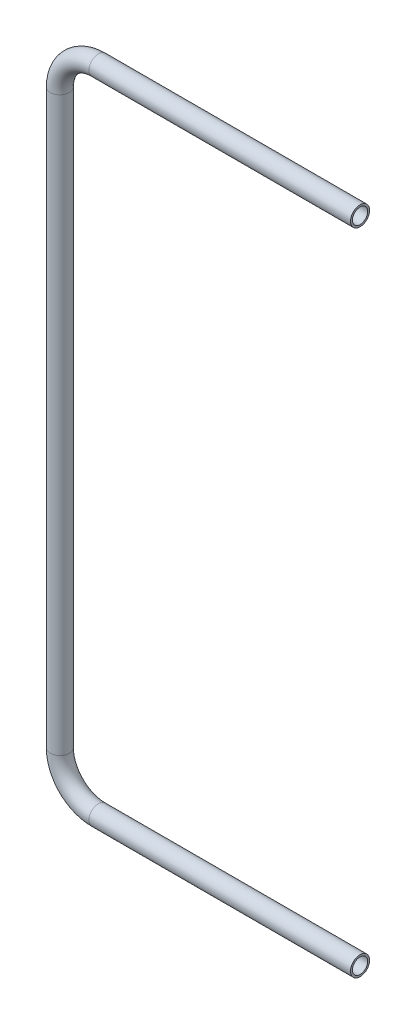
ISO-10303-21;
HEADER;
FILE_DESCRIPTION(('STEP AP214'),'2;1');
FILE_NAME('part.step','',(''),(''),'','','');
FILE_SCHEMA(('AUTOMOTIVE_DESIGN { 1 0 10303 214 1 1 1 1 }'));
ENDSEC;
DATA;
#1=APPLICATION_CONTEXT('core data for automotive mechanical design processes');
#2=APPLICATION_PROTOCOL_DEFINITION('international standard','automotive_design',2000,#1);
#3=PRODUCT_CONTEXT('',#1,'mechanical');
#4=PRODUCT('Part','Part','',(#3));
#5=PRODUCT_RELATED_PRODUCT_CATEGORY('part','',(#4));
#6=PRODUCT_DEFINITION_FORMATION('','',#4);
#7=PRODUCT_DEFINITION_CONTEXT('part definition',#1,'design');
#8=PRODUCT_DEFINITION('design','',#6,#7);
#9=PRODUCT_DEFINITION_SHAPE('','',#8);
#10=(LENGTH_UNIT() NAMED_UNIT(*) SI_UNIT(.MILLI.,.METRE.));
#11=(NAMED_UNIT(*) PLANE_ANGLE_UNIT() SI_UNIT($,.RADIAN.));
#12=(NAMED_UNIT(*) SI_UNIT($,.STERADIAN.) SOLID_ANGLE_UNIT());
#13=UNCERTAINTY_MEASURE_WITH_UNIT(LENGTH_MEASURE(1.E-05),#10,'distance_accuracy_value','');
#14=(GEOMETRIC_REPRESENTATION_CONTEXT(3) GLOBAL_UNCERTAINTY_ASSIGNED_CONTEXT((#13)) GLOBAL_UNIT_ASSIGNED_CONTEXT((#10,
#11,#12)) REPRESENTATION_CONTEXT('',''));
#15=CARTESIAN_POINT('',(0.,0.,0.));
#16=DIRECTION('',(0.,0.,1.));
#17=DIRECTION('',(1.,0.,0.));
#18=AXIS2_PLACEMENT_3D('',#15,#16,#17);
#19=CARTESIAN_POINT('',(0.,0.,0.));
#20=DIRECTION('',(-1.,0.,0.));
#21=DIRECTION('',(0.,-1.,0.));
#22=AXIS2_PLACEMENT_3D('',#19,#20,#21);
#23=CYLINDRICAL_SURFACE('',#22,16.7005);
#24=CARTESIAN_POINT('',(-457.2,0.,0.));
#25=DIRECTION('',(1.,0.,0.));
#26=DIRECTION('',(0.,0.,-1.));
#27=AXIS2_PLACEMENT_3D('',#24,#25,#26);
#28=CIRCLE('',#27,16.7005);
#29=CARTESIAN_POINT('',(-457.2,-16.7005000000001,0.));
#30=VERTEX_POINT('',#29);
#31=EDGE_CURVE('E113',#30,#30,#28,.T.);
#32=ORIENTED_EDGE('',*,*,#31,.T.);
#33=EDGE_LOOP('',(#32));
#34=FACE_BOUND('',#33,.T.);
#35=CARTESIAN_POINT('',(0.,0.,0.));
#36=DIRECTION('',(1.,0.,0.));
#37=DIRECTION('',(0.,0.,-1.));
#38=AXIS2_PLACEMENT_3D('',#35,#36,#37);
#39=CIRCLE('',#38,16.7005);
#40=CARTESIAN_POINT('',(0.,0.,-16.7005));
#41=VERTEX_POINT('',#40);
#42=EDGE_CURVE('E47',#41,#41,#39,.T.);
#43=ORIENTED_EDGE('',*,*,#42,.F.);
#44=EDGE_LOOP('',(#43));
#45=FACE_BOUND('',#44,.T.);
#46=ADVANCED_FACE('F32',(#34,#45),#23,.T.);
#47=CARTESIAN_POINT('',(-457.2,67.5004999999999,0.));
#48=DIRECTION('',(0.,0.,-1.));
#49=DIRECTION('',(-1.,0.,0.));
#50=AXIS2_PLACEMENT_3D('',#47,#48,#49);
#51=TOROIDAL_SURFACE('',#50,67.5005,16.7005);
#52=CARTESIAN_POINT('',(-524.7005,67.5004999999999,0.));
#53=DIRECTION('',(0.,-1.,0.));
#54=DIRECTION('',(0.,0.,-1.));
#55=AXIS2_PLACEMENT_3D('',#52,#53,#54);
#56=CIRCLE('',#55,16.7005);
#57=CARTESIAN_POINT('',(-541.401,67.5004999999999,0.));
#58=VERTEX_POINT('',#57);
#59=EDGE_CURVE('E116',#58,#58,#56,.T.);
#60=CARTESIAN_POINT('',(-457.2,67.5004999999999,0.));
#61=DIRECTION('',(0.,0.,-1.));
#62=DIRECTION('',(-1.,0.,0.));
#63=AXIS2_PLACEMENT_3D('',#60,#61,#62);
#64=CIRCLE('',#63,84.201);
#65=EDGE_CURVE('',#30,#58,#64,.T.);
#66=ORIENTED_EDGE('',*,*,#31,.F.);
#67=ORIENTED_EDGE('',*,*,#59,.T.);
#68=ORIENTED_EDGE('',*,*,#65,.T.);
#69=ORIENTED_EDGE('',*,*,#65,.F.);
#70=EDGE_LOOP('',(#66,#68,#67,#69));
#71=FACE_BOUND('',#70,.T.);
#72=ADVANCED_FACE('F137',(#71),#51,.T.);
#73=CARTESIAN_POINT('',(-524.7005,67.5004999999999,0.));
#74=DIRECTION('',(0.,1.,0.));
#75=DIRECTION('',(-1.,0.,0.));
#76=AXIS2_PLACEMENT_3D('',#73,#74,#75);
#77=CYLINDRICAL_SURFACE('',#76,16.7005);
#78=CARTESIAN_POINT('',(-524.7005,1067.562,0.));
#79=DIRECTION('',(0.,-1.,0.));
#80=DIRECTION('',(0.,0.,-1.));
#81=AXIS2_PLACEMENT_3D('',#78,#79,#80);
#82=CIRCLE('',#81,16.7005);
#83=CARTESIAN_POINT('',(-541.401,1067.562,0.));
#84=VERTEX_POINT('',#83);
#85=EDGE_CURVE('E118',#84,#84,#82,.T.);
#86=ORIENTED_EDGE('',*,*,#85,.T.);
#87=EDGE_LOOP('',(#86));
#88=FACE_BOUND('',#87,.T.);
#89=ORIENTED_EDGE('',*,*,#59,.F.);
#90=EDGE_LOOP('',(#89));
#91=FACE_BOUND('',#90,.T.);
#92=ADVANCED_FACE('F133',(#88,#91),#77,.T.);
#93=CARTESIAN_POINT('',(-457.2,1067.562,0.));
#94=DIRECTION('',(0.,0.,-1.));
#95=DIRECTION('',(-1.,0.,0.));
#96=AXIS2_PLACEMENT_3D('',#93,#94,#95);
#97=TOROIDAL_SURFACE('',#96,67.5005,16.7005);
#98=CARTESIAN_POINT('',(-457.2,1135.0625,0.));
#99=DIRECTION('',(-1.,0.,0.));
#100=DIRECTION('',(0.,0.,-1.));
#101=AXIS2_PLACEMENT_3D('',#98,#99,#100);
#102=CIRCLE('',#101,16.7005);
#103=CARTESIAN_POINT('',(-457.2,1151.763,0.));
#104=VERTEX_POINT('',#103);
#105=EDGE_CURVE('E36',#104,#104,#102,.T.);
#106=CARTESIAN_POINT('',(-457.2,1067.562,0.));
#107=DIRECTION('',(0.,0.,-1.));
#108=DIRECTION('',(-1.,0.,0.));
#109=AXIS2_PLACEMENT_3D('',#106,#107,#108);
#110=CIRCLE('',#109,84.201);
#111=EDGE_CURVE('',#84,#104,#110,.T.);
#112=ORIENTED_EDGE('',*,*,#85,.F.);
#113=ORIENTED_EDGE('',*,*,#105,.T.);
#114=ORIENTED_EDGE('',*,*,#111,.T.);
#115=ORIENTED_EDGE('',*,*,#111,.F.);
#116=EDGE_LOOP('',(#112,#114,#113,#115));
#117=FACE_BOUND('',#116,.T.);
#118=ADVANCED_FACE('F125',(#117),#97,.T.);
#119=CARTESIAN_POINT('',(-457.2,1135.0625,0.));
#120=DIRECTION('',(1.,0.,0.));
#121=DIRECTION('',(0.,1.,0.));
#122=AXIS2_PLACEMENT_3D('',#119,#120,#121);
#123=CYLINDRICAL_SURFACE('',#122,16.7005);
#124=CARTESIAN_POINT('',(-3.33066907387547E-13,1135.0625,0.));
#125=DIRECTION('',(-1.,0.,0.));
#126=DIRECTION('',(0.,0.,-1.));
#127=AXIS2_PLACEMENT_3D('',#124,#125,#126);
#128=CIRCLE('',#127,16.7005);
#129=CARTESIAN_POINT('',(-3.33066907387547E-13,1135.0625,-16.7005));
#130=VERTEX_POINT('',#129);
#131=EDGE_CURVE('E52',#130,#130,#128,.T.);
#132=ORIENTED_EDGE('',*,*,#131,.T.);
#133=EDGE_LOOP('',(#132));
#134=FACE_BOUND('',#133,.T.);
#135=ORIENTED_EDGE('',*,*,#105,.F.);
#136=EDGE_LOOP('',(#135));
#137=FACE_BOUND('',#136,.T.);
#138=ADVANCED_FACE('F34',(#134,#137),#123,.T.);
#139=CARTESIAN_POINT('',(0.,0.,0.));
#140=DIRECTION('',(1.,0.,0.));
#141=DIRECTION('',(0.,0.,-1.));
#142=AXIS2_PLACEMENT_3D('',#139,#140,#141);
#143=PLANE('',#142);
#144=CARTESIAN_POINT('',(0.,0.,0.));
#145=DIRECTION('',(1.,0.,0.));
#146=DIRECTION('',(0.,0.,-1.));
#147=AXIS2_PLACEMENT_3D('',#144,#145,#146);
#148=CIRCLE('',#147,13.335);
#149=CARTESIAN_POINT('',(0.,0.,-13.335));
#150=VERTEX_POINT('',#149);
#151=EDGE_CURVE('E100',#150,#150,#148,.F.);
#152=ORIENTED_EDGE('',*,*,#151,.T.);
#153=EDGE_LOOP('',(#152));
#154=FACE_BOUND('',#153,.T.);
#155=ORIENTED_EDGE('',*,*,#42,.T.);
#156=EDGE_LOOP('',(#155));
#157=FACE_BOUND('',#156,.T.);
#158=ADVANCED_FACE('F65',(#154,#157),#143,.T.);
#159=CARTESIAN_POINT('',(-3.33066907387547E-13,1135.0625,0.));
#160=DIRECTION('',(-1.,0.,0.));
#161=DIRECTION('',(0.,0.,-1.));
#162=AXIS2_PLACEMENT_3D('',#159,#160,#161);
#163=PLANE('',#162);
#164=CARTESIAN_POINT('',(-3.33066907387547E-13,1135.0625,0.));
#165=DIRECTION('',(-1.,0.,0.));
#166=DIRECTION('',(0.,0.,-1.));
#167=AXIS2_PLACEMENT_3D('',#164,#165,#166);
#168=CIRCLE('',#167,13.335);
#169=CARTESIAN_POINT('',(-3.33066907387547E-13,1135.0625,-13.335));
#170=VERTEX_POINT('',#169);
#171=EDGE_CURVE('E11',#170,#170,#168,.F.);
#172=ORIENTED_EDGE('',*,*,#171,.F.);
#173=EDGE_LOOP('',(#172));
#174=FACE_BOUND('',#173,.T.);
#175=ORIENTED_EDGE('',*,*,#131,.F.);
#176=EDGE_LOOP('',(#175));
#177=FACE_BOUND('',#176,.T.);
#178=ADVANCED_FACE('F62',(#174,#177),#163,.F.);
#179=CARTESIAN_POINT('',(0.,0.,0.));
#180=DIRECTION('',(-1.,0.,0.));
#181=DIRECTION('',(0.,-1.,0.));
#182=AXIS2_PLACEMENT_3D('',#179,#180,#181);
#183=CYLINDRICAL_SURFACE('',#182,13.335);
#184=CARTESIAN_POINT('',(-457.2,0.,0.));
#185=DIRECTION('',(1.,0.,0.));
#186=DIRECTION('',(0.,0.,-1.));
#187=AXIS2_PLACEMENT_3D('',#184,#185,#186);
#188=CIRCLE('',#187,13.335);
#189=CARTESIAN_POINT('',(-457.2,-13.3350000000001,0.));
#190=VERTEX_POINT('',#189);
#191=EDGE_CURVE('E99',#190,#190,#188,.F.);
#192=ORIENTED_EDGE('',*,*,#191,.T.);
#193=EDGE_LOOP('',(#192));
#194=FACE_BOUND('',#193,.T.);
#195=ORIENTED_EDGE('',*,*,#151,.F.);
#196=EDGE_LOOP('',(#195));
#197=FACE_BOUND('',#196,.T.);
#198=ADVANCED_FACE('F64',(#194,#197),#183,.F.);
#199=CARTESIAN_POINT('',(-457.2,67.5004999999999,0.));
#200=DIRECTION('',(0.,0.,-1.));
#201=DIRECTION('',(-1.,0.,0.));
#202=AXIS2_PLACEMENT_3D('',#199,#200,#201);
#203=TOROIDAL_SURFACE('',#202,67.5005,13.335);
#204=CARTESIAN_POINT('',(-524.7005,67.5004999999999,0.));
#205=DIRECTION('',(0.,-1.,0.));
#206=DIRECTION('',(0.,0.,-1.));
#207=AXIS2_PLACEMENT_3D('',#204,#205,#206);
#208=CIRCLE('',#207,13.335);
#209=CARTESIAN_POINT('',(-538.0355,67.5004999999999,0.));
#210=VERTEX_POINT('',#209);
#211=EDGE_CURVE('E96',#210,#210,#208,.F.);
#212=CARTESIAN_POINT('',(-457.2,67.5004999999999,0.));
#213=DIRECTION('',(0.,0.,-1.));
#214=DIRECTION('',(-1.,0.,0.));
#215=AXIS2_PLACEMENT_3D('',#212,#213,#214);
#216=CIRCLE('',#215,80.8355);
#217=EDGE_CURVE('',#190,#210,#216,.T.);
#218=ORIENTED_EDGE('',*,*,#191,.F.);
#219=ORIENTED_EDGE('',*,*,#211,.T.);
#220=ORIENTED_EDGE('',*,*,#217,.T.);
#221=ORIENTED_EDGE('',*,*,#217,.F.);
#222=EDGE_LOOP('',(#218,#220,#219,#221));
#223=FACE_BOUND('',#222,.T.);
#224=ADVANCED_FACE('F71',(#223),#203,.F.);
#225=CARTESIAN_POINT('',(-524.7005,67.5004999999999,0.));
#226=DIRECTION('',(0.,1.,0.));
#227=DIRECTION('',(-1.,0.,0.));
#228=AXIS2_PLACEMENT_3D('',#225,#226,#227);
#229=CYLINDRICAL_SURFACE('',#228,13.335);
#230=CARTESIAN_POINT('',(-524.7005,1067.562,0.));
#231=DIRECTION('',(0.,-1.,0.));
#232=DIRECTION('',(0.,0.,-1.));
#233=AXIS2_PLACEMENT_3D('',#230,#231,#232);
#234=CIRCLE('',#233,13.335);
#235=CARTESIAN_POINT('',(-538.0355,1067.562,0.));
#236=VERTEX_POINT('',#235);
#237=EDGE_CURVE('E102',#236,#236,#234,.F.);
#238=ORIENTED_EDGE('',*,*,#237,.T.);
#239=EDGE_LOOP('',(#238));
#240=FACE_BOUND('',#239,.T.);
#241=ORIENTED_EDGE('',*,*,#211,.F.);
#242=EDGE_LOOP('',(#241));
#243=FACE_BOUND('',#242,.T.);
#244=ADVANCED_FACE('F82',(#240,#243),#229,.F.);
#245=CARTESIAN_POINT('',(-457.2,1067.562,0.));
#246=DIRECTION('',(0.,0.,-1.));
#247=DIRECTION('',(-1.,0.,0.));
#248=AXIS2_PLACEMENT_3D('',#245,#246,#247);
#249=TOROIDAL_SURFACE('',#248,67.5005,13.335);
#250=CARTESIAN_POINT('',(-457.2,1135.0625,0.));
#251=DIRECTION('',(-1.,0.,0.));
#252=DIRECTION('',(0.,0.,-1.));
#253=AXIS2_PLACEMENT_3D('',#250,#251,#252);
#254=CIRCLE('',#253,13.335);
#255=CARTESIAN_POINT('',(-457.2,1148.3975,0.));
#256=VERTEX_POINT('',#255);
#257=EDGE_CURVE('E41',#256,#256,#254,.F.);
#258=CARTESIAN_POINT('',(-457.2,1067.562,0.));
#259=DIRECTION('',(0.,0.,-1.));
#260=DIRECTION('',(-1.,0.,0.));
#261=AXIS2_PLACEMENT_3D('',#258,#259,#260);
#262=CIRCLE('',#261,80.8355);
#263=EDGE_CURVE('',#236,#256,#262,.T.);
#264=ORIENTED_EDGE('',*,*,#237,.F.);
#265=ORIENTED_EDGE('',*,*,#257,.T.);
#266=ORIENTED_EDGE('',*,*,#263,.T.);
#267=ORIENTED_EDGE('',*,*,#263,.F.);
#268=EDGE_LOOP('',(#264,#266,#265,#267));
#269=FACE_BOUND('',#268,.T.);
#270=ADVANCED_FACE('F78',(#269),#249,.F.);
#271=CARTESIAN_POINT('',(-457.2,1135.0625,0.));
#272=DIRECTION('',(1.,0.,0.));
#273=DIRECTION('',(0.,1.,0.));
#274=AXIS2_PLACEMENT_3D('',#271,#272,#273);
#275=CYLINDRICAL_SURFACE('',#274,13.335);
#276=ORIENTED_EDGE('',*,*,#171,.T.);
#277=EDGE_LOOP('',(#276));
#278=FACE_BOUND('',#277,.T.);
#279=ORIENTED_EDGE('',*,*,#257,.F.);
#280=EDGE_LOOP('',(#279));
#281=FACE_BOUND('',#280,.T.);
#282=ADVANCED_FACE('F59',(#278,#281),#275,.F.);
#283=CLOSED_SHELL('',(#46,#72,#92,#118,#138,#158,#178,#198,#224,#244,#270,#282));
#284=MANIFOLD_SOLID_BREP('B2',#283);
#285=ADVANCED_BREP_SHAPE_REPRESENTATION('',(#18,#284),#14);
#286=SHAPE_DEFINITION_REPRESENTATION(#9,#285);
ENDSEC;
END-ISO-10303-21;
